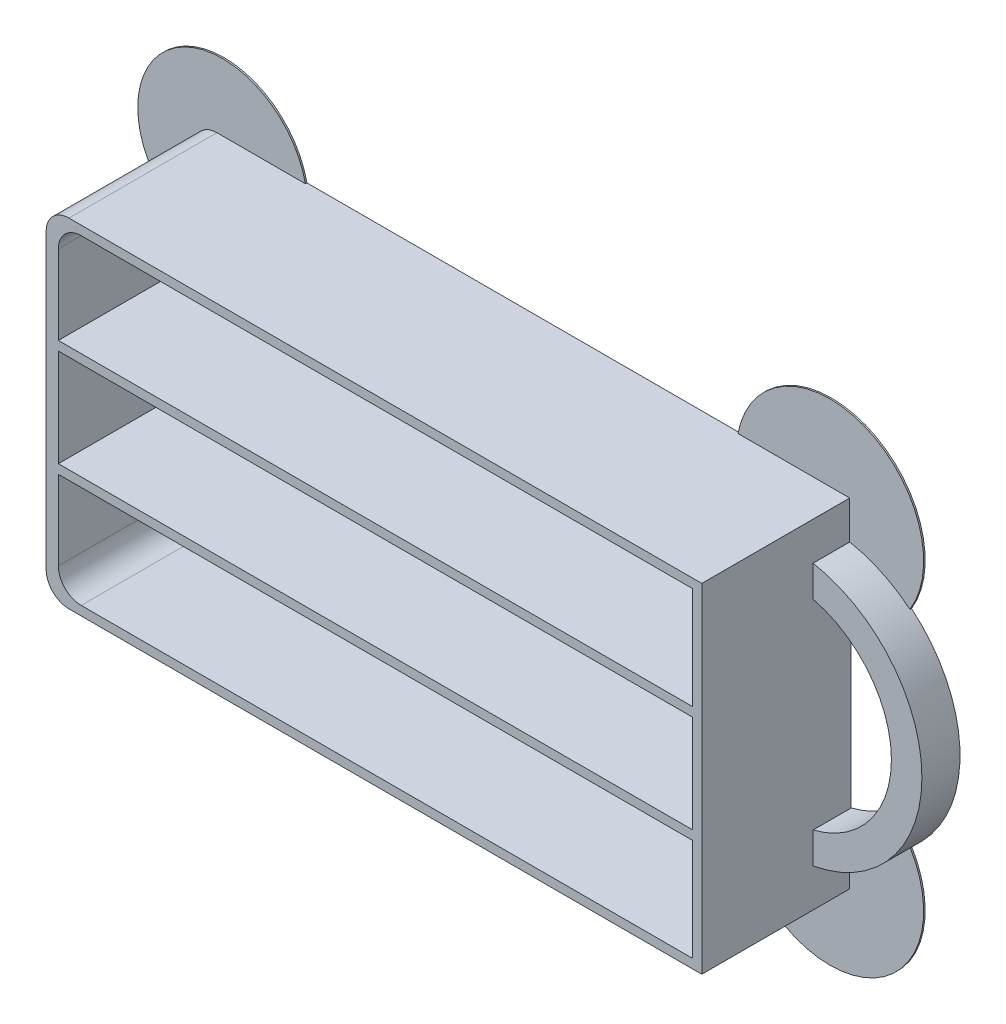
ISO-10303-21;
HEADER;
FILE_DESCRIPTION(('STEP AP214'),'2;1');
FILE_NAME('part.step','',(''),(''),'','','');
FILE_SCHEMA(('AUTOMOTIVE_DESIGN { 1 0 10303 214 1 1 1 1 }'));
ENDSEC;
DATA;
#1=APPLICATION_CONTEXT('core data for automotive mechanical design processes');
#2=APPLICATION_PROTOCOL_DEFINITION('international standard','automotive_design',2000,#1);
#3=PRODUCT_CONTEXT('',#1,'mechanical');
#4=PRODUCT('Part','Part','',(#3));
#5=PRODUCT_RELATED_PRODUCT_CATEGORY('part','',(#4));
#6=PRODUCT_DEFINITION_FORMATION('','',#4);
#7=PRODUCT_DEFINITION_CONTEXT('part definition',#1,'design');
#8=PRODUCT_DEFINITION('design','',#6,#7);
#9=PRODUCT_DEFINITION_SHAPE('','',#8);
#10=(LENGTH_UNIT() NAMED_UNIT(*) SI_UNIT(.MILLI.,.METRE.));
#11=(NAMED_UNIT(*) PLANE_ANGLE_UNIT() SI_UNIT($,.RADIAN.));
#12=(NAMED_UNIT(*) SI_UNIT($,.STERADIAN.) SOLID_ANGLE_UNIT());
#13=UNCERTAINTY_MEASURE_WITH_UNIT(LENGTH_MEASURE(1.E-05),#10,'distance_accuracy_value','');
#14=(GEOMETRIC_REPRESENTATION_CONTEXT(3) GLOBAL_UNCERTAINTY_ASSIGNED_CONTEXT((#13)) GLOBAL_UNIT_ASSIGNED_CONTEXT((#10,
#11,#12)) REPRESENTATION_CONTEXT('',''));
#15=CARTESIAN_POINT('',(0.,0.,0.));
#16=DIRECTION('',(0.,0.,1.));
#17=DIRECTION('',(1.,0.,0.));
#18=AXIS2_PLACEMENT_3D('',#15,#16,#17);
#19=CARTESIAN_POINT('',(-40.,-19.2,19.6));
#20=DIRECTION('',(0.,0.,-1.));
#21=DIRECTION('',(-1.,0.,0.));
#22=AXIS2_PLACEMENT_3D('',#19,#20,#21);
#23=CYLINDRICAL_SURFACE('',#22,3.);
#24=DIRECTION('',(0.,0.,-1.));
#25=VECTOR('',#24,1.);
#26=CARTESIAN_POINT('',(-43.,-19.2,19.6));
#27=LINE('',#26,#25);
#28=CARTESIAN_POINT('',(-43.,-19.2,0.199999999999999));
#29=VERTEX_POINT('',#28);
#30=CARTESIAN_POINT('',(-43.,-19.2,19.6));
#31=VERTEX_POINT('',#30);
#32=EDGE_CURVE('E462',#29,#31,#27,.F.);
#33=ORIENTED_EDGE('',*,*,#32,.F.);
#34=CARTESIAN_POINT('',(-40.,-19.2,0.199999999999999));
#35=DIRECTION('',(0.,0.,-1.));
#36=DIRECTION('',(-1.,0.,0.));
#37=AXIS2_PLACEMENT_3D('',#34,#35,#36);
#38=CIRCLE('',#37,3.);
#39=CARTESIAN_POINT('',(-40.,-22.2,0.199999999999999));
#40=VERTEX_POINT('',#39);
#41=EDGE_CURVE('E49',#29,#40,#38,.F.);
#42=ORIENTED_EDGE('',*,*,#41,.T.);
#43=DIRECTION('',(0.,0.,-1.));
#44=VECTOR('',#43,1.);
#45=CARTESIAN_POINT('',(-40.,-22.2,19.6));
#46=LINE('',#45,#44);
#47=CARTESIAN_POINT('',(-40.,-22.2,19.6));
#48=VERTEX_POINT('',#47);
#49=EDGE_CURVE('E473',#48,#40,#46,.T.);
#50=ORIENTED_EDGE('',*,*,#49,.F.);
#51=CARTESIAN_POINT('',(-40.,-19.2,19.6));
#52=DIRECTION('',(0.,0.,1.));
#53=DIRECTION('',(1.,0.,0.));
#54=AXIS2_PLACEMENT_3D('',#51,#52,#53);
#55=CIRCLE('',#54,3.);
#56=EDGE_CURVE('E469',#31,#48,#55,.T.);
#57=ORIENTED_EDGE('',*,*,#56,.F.);
#58=EDGE_LOOP('',(#33,#42,#50,#57));
#59=FACE_BOUND('',#58,.T.);
#60=ADVANCED_FACE('F41',(#59),#23,.T.);
#61=CARTESIAN_POINT('',(43.,22.2,19.6));
#62=DIRECTION('',(-1.,0.,0.));
#63=DIRECTION('',(0.,-1.,0.));
#64=AXIS2_PLACEMENT_3D('',#61,#62,#63);
#65=PLANE('',#64);
#66=DIRECTION('',(0.,0.,-1.));
#67=VECTOR('',#66,1.);
#68=CARTESIAN_POINT('',(43.,-22.2,19.6));
#69=LINE('',#68,#67);
#70=CARTESIAN_POINT('',(43.,-22.2,19.6));
#71=VERTEX_POINT('',#70);
#72=CARTESIAN_POINT('',(43.,-22.2,0.199999999999999));
#73=VERTEX_POINT('',#72);
#74=EDGE_CURVE('E449',#71,#73,#69,.T.);
#75=ORIENTED_EDGE('',*,*,#74,.T.);
#76=DIRECTION('',(0.,1.,0.));
#77=VECTOR('',#76,1.);
#78=CARTESIAN_POINT('',(43.,22.2,0.199999999999999));
#79=LINE('',#78,#77);
#80=CARTESIAN_POINT('',(43.,-17.2,0.2));
#81=VERTEX_POINT('',#80);
#82=EDGE_CURVE('E273',#73,#81,#79,.T.);
#83=ORIENTED_EDGE('',*,*,#82,.T.);
#84=DIRECTION('',(0.,0.,-1.));
#85=VECTOR('',#84,1.);
#86=CARTESIAN_POINT('',(43.,-17.2,5.));
#87=LINE('',#86,#85);
#88=CARTESIAN_POINT('',(43.,-17.2,5.));
#89=VERTEX_POINT('',#88);
#90=EDGE_CURVE('E422',#89,#81,#87,.T.);
#91=ORIENTED_EDGE('',*,*,#90,.F.);
#92=DIRECTION('',(0.,-1.,0.));
#93=VECTOR('',#92,1.);
#94=CARTESIAN_POINT('',(43.,-17.2,5.));
#95=LINE('',#94,#93);
#96=CARTESIAN_POINT('',(43.,-13.1087756865391,5.));
#97=VERTEX_POINT('',#96);
#98=EDGE_CURVE('E420',#97,#89,#95,.T.);
#99=ORIENTED_EDGE('',*,*,#98,.F.);
#100=DIRECTION('',(0.,0.,-1.));
#101=VECTOR('',#100,1.);
#102=CARTESIAN_POINT('',(43.,-13.1087756865391,5.));
#103=LINE('',#102,#101);
#104=CARTESIAN_POINT('',(43.,-13.1087756865391,0.));
#105=VERTEX_POINT('',#104);
#106=EDGE_CURVE('E427',#97,#105,#103,.T.);
#107=ORIENTED_EDGE('',*,*,#106,.T.);
#108=DIRECTION('',(0.,1.,0.));
#109=VECTOR('',#108,1.);
#110=CARTESIAN_POINT('',(43.,22.2,0.));
#111=LINE('',#110,#109);
#112=CARTESIAN_POINT('',(43.,13.1087756865391,0.));
#113=VERTEX_POINT('',#112);
#114=EDGE_CURVE('E436',#105,#113,#111,.T.);
#115=ORIENTED_EDGE('',*,*,#114,.T.);
#116=DIRECTION('',(0.,0.,-1.));
#117=VECTOR('',#116,1.);
#118=CARTESIAN_POINT('',(43.,13.1087756865391,5.));
#119=LINE('',#118,#117);
#120=CARTESIAN_POINT('',(43.,13.1087756865391,5.));
#121=VERTEX_POINT('',#120);
#122=EDGE_CURVE('E430',#121,#113,#119,.T.);
#123=ORIENTED_EDGE('',*,*,#122,.F.);
#124=DIRECTION('',(0.,-1.,0.));
#125=VECTOR('',#124,1.);
#126=CARTESIAN_POINT('',(43.,17.2,5.));
#127=LINE('',#126,#125);
#128=CARTESIAN_POINT('',(43.,17.2,5.));
#129=VERTEX_POINT('',#128);
#130=EDGE_CURVE('E414',#129,#121,#127,.T.);
#131=ORIENTED_EDGE('',*,*,#130,.F.);
#132=DIRECTION('',(0.,0.,-1.));
#133=VECTOR('',#132,1.);
#134=CARTESIAN_POINT('',(43.,17.2,5.));
#135=LINE('',#134,#133);
#136=CARTESIAN_POINT('',(43.,17.2,0.2));
#137=VERTEX_POINT('',#136);
#138=EDGE_CURVE('E433',#129,#137,#135,.T.);
#139=ORIENTED_EDGE('',*,*,#138,.T.);
#140=DIRECTION('',(0.,-1.,0.));
#141=VECTOR('',#140,1.);
#142=CARTESIAN_POINT('',(43.,22.2,0.199999999999999));
#143=LINE('',#142,#141);
#144=CARTESIAN_POINT('',(43.,22.2,0.199999999999999));
#145=VERTEX_POINT('',#144);
#146=EDGE_CURVE('E320',#145,#137,#143,.T.);
#147=ORIENTED_EDGE('',*,*,#146,.F.);
#148=DIRECTION('',(0.,0.,-1.));
#149=VECTOR('',#148,1.);
#150=CARTESIAN_POINT('',(43.,22.2,19.6));
#151=LINE('',#150,#149);
#152=CARTESIAN_POINT('',(43.,22.2,19.6));
#153=VERTEX_POINT('',#152);
#154=EDGE_CURVE('E459',#153,#145,#151,.T.);
#155=ORIENTED_EDGE('',*,*,#154,.F.);
#156=DIRECTION('',(0.,1.,0.));
#157=VECTOR('',#156,1.);
#158=CARTESIAN_POINT('',(43.,22.2,19.6));
#159=LINE('',#158,#157);
#160=EDGE_CURVE('E437',#71,#153,#159,.T.);
#161=ORIENTED_EDGE('',*,*,#160,.F.);
#162=EDGE_LOOP('',(#75,#83,#91,#99,#107,#115,#123,#131,#139,#147,#155,#161));
#163=FACE_BOUND('',#162,.T.);
#164=ADVANCED_FACE('F545',(#163),#65,.F.);
#165=CARTESIAN_POINT('',(0.,0.,19.6));
#166=DIRECTION('',(0.,0.,1.));
#167=DIRECTION('',(1.,0.,0.));
#168=AXIS2_PLACEMENT_3D('',#165,#166,#167);
#169=PLANE('',#168);
#170=DIRECTION('',(-1.,0.,0.));
#171=VECTOR('',#170,1.);
#172=CARTESIAN_POINT('',(0.,21.,19.6));
#173=LINE('',#172,#171);
#174=CARTESIAN_POINT('',(41.8,21.,19.6));
#175=VERTEX_POINT('',#174);
#176=CARTESIAN_POINT('',(-38.4,21.,19.6));
#177=VERTEX_POINT('',#176);
#178=EDGE_CURVE('E336',#175,#177,#173,.T.);
#179=ORIENTED_EDGE('',*,*,#178,.F.);
#180=DIRECTION('',(0.,1.,0.));
#181=VECTOR('',#180,1.);
#182=CARTESIAN_POINT('',(41.8,0.,19.6));
#183=LINE('',#182,#181);
#184=CARTESIAN_POINT('',(41.8,7.6,19.6));
#185=VERTEX_POINT('',#184);
#186=EDGE_CURVE('E345',#185,#175,#183,.T.);
#187=ORIENTED_EDGE('',*,*,#186,.F.);
#188=DIRECTION('',(-1.,0.,0.));
#189=VECTOR('',#188,1.);
#190=CARTESIAN_POINT('',(0.,7.6,19.6));
#191=LINE('',#190,#189);
#192=CARTESIAN_POINT('',(-41.4,7.6,19.6));
#193=VERTEX_POINT('',#192);
#194=EDGE_CURVE('E342',#185,#193,#191,.T.);
#195=ORIENTED_EDGE('',*,*,#194,.T.);
#196=DIRECTION('',(0.,-1.,0.));
#197=VECTOR('',#196,1.);
#198=CARTESIAN_POINT('',(-41.4,0.,19.6));
#199=LINE('',#198,#197);
#200=CARTESIAN_POINT('',(-41.4,18.,19.6));
#201=VERTEX_POINT('',#200);
#202=EDGE_CURVE('E339',#201,#193,#199,.T.);
#203=ORIENTED_EDGE('',*,*,#202,.F.);
#204=CARTESIAN_POINT('',(-38.4,18.,19.6));
#205=DIRECTION('',(0.,0.,1.));
#206=DIRECTION('',(1.,0.,0.));
#207=AXIS2_PLACEMENT_3D('',#204,#205,#206);
#208=CIRCLE('',#207,3.);
#209=EDGE_CURVE('E492',#201,#177,#208,.F.);
#210=ORIENTED_EDGE('',*,*,#209,.T.);
#211=EDGE_LOOP('',(#179,#187,#195,#203,#210));
#212=FACE_BOUND('',#211,.T.);
#213=DIRECTION('',(0.,1.,0.));
#214=VECTOR('',#213,1.);
#215=CARTESIAN_POINT('',(41.8,0.,19.6));
#216=LINE('',#215,#214);
#217=CARTESIAN_POINT('',(41.8,-21.,19.6));
#218=VERTEX_POINT('',#217);
#219=CARTESIAN_POINT('',(41.8,-7.6,19.6));
#220=VERTEX_POINT('',#219);
#221=EDGE_CURVE('E327',#218,#220,#216,.T.);
#222=ORIENTED_EDGE('',*,*,#221,.F.);
#223=DIRECTION('',(1.,0.,0.));
#224=VECTOR('',#223,1.);
#225=CARTESIAN_POINT('',(0.,-21.,19.6));
#226=LINE('',#225,#224);
#227=CARTESIAN_POINT('',(-38.4,-21.,19.6));
#228=VERTEX_POINT('',#227);
#229=EDGE_CURVE('E401',#228,#218,#226,.T.);
#230=ORIENTED_EDGE('',*,*,#229,.F.);
#231=CARTESIAN_POINT('',(-38.4,-18.,19.6));
#232=DIRECTION('',(0.,0.,1.));
#233=DIRECTION('',(1.,0.,0.));
#234=AXIS2_PLACEMENT_3D('',#231,#232,#233);
#235=CIRCLE('',#234,3.);
#236=CARTESIAN_POINT('',(-41.4,-18.,19.6));
#237=VERTEX_POINT('',#236);
#238=EDGE_CURVE('E490',#228,#237,#235,.F.);
#239=ORIENTED_EDGE('',*,*,#238,.T.);
#240=DIRECTION('',(0.,-1.,0.));
#241=VECTOR('',#240,1.);
#242=CARTESIAN_POINT('',(-41.4,0.,19.6));
#243=LINE('',#242,#241);
#244=CARTESIAN_POINT('',(-41.4,-7.6,19.6));
#245=VERTEX_POINT('',#244);
#246=EDGE_CURVE('E398',#245,#237,#243,.T.);
#247=ORIENTED_EDGE('',*,*,#246,.F.);
#248=DIRECTION('',(-1.,0.,0.));
#249=VECTOR('',#248,1.);
#250=CARTESIAN_POINT('',(0.,-7.6,19.6));
#251=LINE('',#250,#249);
#252=EDGE_CURVE('E395',#220,#245,#251,.T.);
#253=ORIENTED_EDGE('',*,*,#252,.F.);
#254=EDGE_LOOP('',(#222,#230,#239,#247,#253));
#255=FACE_BOUND('',#254,.T.);
#256=DIRECTION('',(-1.,0.,0.));
#257=VECTOR('',#256,1.);
#258=CARTESIAN_POINT('',(-43.,22.2,19.6));
#259=LINE('',#258,#257);
#260=CARTESIAN_POINT('',(-40.,22.2,19.6));
#261=VERTEX_POINT('',#260);
#262=EDGE_CURVE('E440',#153,#261,#259,.T.);
#263=ORIENTED_EDGE('',*,*,#262,.T.);
#264=CARTESIAN_POINT('',(-40.,19.2,19.6));
#265=DIRECTION('',(0.,0.,1.));
#266=DIRECTION('',(1.,0.,0.));
#267=AXIS2_PLACEMENT_3D('',#264,#265,#266);
#268=CIRCLE('',#267,3.);
#269=CARTESIAN_POINT('',(-43.,19.2,19.6));
#270=VERTEX_POINT('',#269);
#271=EDGE_CURVE('E471',#261,#270,#268,.T.);
#272=ORIENTED_EDGE('',*,*,#271,.T.);
#273=DIRECTION('',(0.,-1.,0.));
#274=VECTOR('',#273,1.);
#275=CARTESIAN_POINT('',(-43.,22.2,19.6));
#276=LINE('',#275,#274);
#277=EDGE_CURVE('E444',#270,#31,#276,.T.);
#278=ORIENTED_EDGE('',*,*,#277,.T.);
#279=ORIENTED_EDGE('',*,*,#56,.T.);
#280=DIRECTION('',(1.,0.,0.));
#281=VECTOR('',#280,1.);
#282=CARTESIAN_POINT('',(-43.,-22.2,19.6));
#283=LINE('',#282,#281);
#284=EDGE_CURVE('E447',#48,#71,#283,.T.);
#285=ORIENTED_EDGE('',*,*,#284,.T.);
#286=ORIENTED_EDGE('',*,*,#160,.T.);
#287=EDGE_LOOP('',(#263,#272,#278,#279,#285,#286));
#288=FACE_BOUND('',#287,.T.);
#289=DIRECTION('',(0.,1.,0.));
#290=VECTOR('',#289,1.);
#291=CARTESIAN_POINT('',(41.8,0.,19.6));
#292=LINE('',#291,#290);
#293=CARTESIAN_POINT('',(41.8,-6.4,19.6));
#294=VERTEX_POINT('',#293);
#295=CARTESIAN_POINT('',(41.8,6.4,19.6));
#296=VERTEX_POINT('',#295);
#297=EDGE_CURVE('E367',#294,#296,#292,.T.);
#298=ORIENTED_EDGE('',*,*,#297,.F.);
#299=DIRECTION('',(-1.,0.,0.));
#300=VECTOR('',#299,1.);
#301=CARTESIAN_POINT('',(0.,-6.4,19.6));
#302=LINE('',#301,#300);
#303=CARTESIAN_POINT('',(-41.4,-6.4,19.6));
#304=VERTEX_POINT('',#303);
#305=EDGE_CURVE('E364',#294,#304,#302,.T.);
#306=ORIENTED_EDGE('',*,*,#305,.T.);
#307=DIRECTION('',(0.,-1.,0.));
#308=VECTOR('',#307,1.);
#309=CARTESIAN_POINT('',(-41.4,0.,19.6));
#310=LINE('',#309,#308);
#311=CARTESIAN_POINT('',(-41.4,6.4,19.6));
#312=VERTEX_POINT('',#311);
#313=EDGE_CURVE('E374',#312,#304,#310,.T.);
#314=ORIENTED_EDGE('',*,*,#313,.F.);
#315=DIRECTION('',(-1.,0.,0.));
#316=VECTOR('',#315,1.);
#317=CARTESIAN_POINT('',(0.,6.4,19.6));
#318=LINE('',#317,#316);
#319=EDGE_CURVE('E371',#296,#312,#318,.T.);
#320=ORIENTED_EDGE('',*,*,#319,.F.);
#321=EDGE_LOOP('',(#298,#306,#314,#320));
#322=FACE_BOUND('',#321,.T.);
#323=ADVANCED_FACE('F510',(#212,#255,#288,#322),#169,.T.);
#324=CARTESIAN_POINT('',(-43.,22.2,19.6));
#325=DIRECTION('',(0.,-1.,0.));
#326=DIRECTION('',(0.,0.,-1.));
#327=AXIS2_PLACEMENT_3D('',#324,#325,#326);
#328=PLANE('',#327);
#329=DIRECTION('',(-1.,0.,0.));
#330=VECTOR('',#329,1.);
#331=CARTESIAN_POINT('',(-43.,22.2,0.));
#332=LINE('',#331,#330);
#333=CARTESIAN_POINT('',(28.3502205420116,22.2,0.));
#334=VERTEX_POINT('',#333);
#335=CARTESIAN_POINT('',(-28.3957505106809,22.2,0.));
#336=VERTEX_POINT('',#335);
#337=EDGE_CURVE('E451',#334,#336,#332,.T.);
#338=ORIENTED_EDGE('',*,*,#337,.T.);
#339=DIRECTION('',(0.,0.,-1.));
#340=VECTOR('',#339,1.);
#341=CARTESIAN_POINT('',(-28.3957505106809,22.2,0.2));
#342=LINE('',#341,#340);
#343=CARTESIAN_POINT('',(-28.3957505106809,22.2,0.2));
#344=VERTEX_POINT('',#343);
#345=EDGE_CURVE('E297',#344,#336,#342,.T.);
#346=ORIENTED_EDGE('',*,*,#345,.F.);
#347=DIRECTION('',(-1.,0.,0.));
#348=VECTOR('',#347,1.);
#349=CARTESIAN_POINT('',(-43.,22.2,0.199999999999999));
#350=LINE('',#349,#348);
#351=CARTESIAN_POINT('',(-40.,22.2,0.199999999999999));
#352=VERTEX_POINT('',#351);
#353=EDGE_CURVE('E310',#344,#352,#350,.T.);
#354=ORIENTED_EDGE('',*,*,#353,.T.);
#355=DIRECTION('',(0.,0.,-1.));
#356=VECTOR('',#355,1.);
#357=CARTESIAN_POINT('',(-40.,22.2,19.6));
#358=LINE('',#357,#356);
#359=EDGE_CURVE('E467',#352,#261,#358,.F.);
#360=ORIENTED_EDGE('',*,*,#359,.T.);
#361=ORIENTED_EDGE('',*,*,#262,.F.);
#362=ORIENTED_EDGE('',*,*,#154,.T.);
#363=DIRECTION('',(1.,0.,0.));
#364=VECTOR('',#363,1.);
#365=CARTESIAN_POINT('',(-43.,22.2,0.199999999999999));
#366=LINE('',#365,#364);
#367=CARTESIAN_POINT('',(28.3502205420118,22.2,0.199999999999999));
#368=VERTEX_POINT('',#367);
#369=EDGE_CURVE('E324',#368,#145,#366,.T.);
#370=ORIENTED_EDGE('',*,*,#369,.F.);
#371=DIRECTION('',(0.,0.,-1.));
#372=VECTOR('',#371,1.);
#373=CARTESIAN_POINT('',(28.3502205420118,22.2,0.2));
#374=LINE('',#373,#372);
#375=EDGE_CURVE('E318',#368,#334,#374,.T.);
#376=ORIENTED_EDGE('',*,*,#375,.T.);
#377=EDGE_LOOP('',(#338,#346,#354,#360,#361,#362,#370,#376));
#378=FACE_BOUND('',#377,.T.);
#379=ADVANCED_FACE('F527',(#378),#328,.F.);
#380=CARTESIAN_POINT('',(-43.,22.2,19.6));
#381=DIRECTION('',(1.,0.,0.));
#382=DIRECTION('',(0.,1.,0.));
#383=AXIS2_PLACEMENT_3D('',#380,#381,#382);
#384=PLANE('',#383);
#385=DIRECTION('',(0.,-1.,0.));
#386=VECTOR('',#385,1.);
#387=CARTESIAN_POINT('',(-43.,22.2,0.));
#388=LINE('',#387,#386);
#389=CARTESIAN_POINT('',(-43.,9.41790296159919,0.));
#390=VERTEX_POINT('',#389);
#391=CARTESIAN_POINT('',(-43.,-9.41790296159919,0.));
#392=VERTEX_POINT('',#391);
#393=EDGE_CURVE('E454',#390,#392,#388,.T.);
#394=ORIENTED_EDGE('',*,*,#393,.T.);
#395=DIRECTION('',(0.,0.,-1.));
#396=VECTOR('',#395,1.);
#397=CARTESIAN_POINT('',(-43.,-9.41790296159919,0.2));
#398=LINE('',#397,#396);
#399=CARTESIAN_POINT('',(-43.,-9.41790296159919,0.2));
#400=VERTEX_POINT('',#399);
#401=EDGE_CURVE('E282',#400,#392,#398,.T.);
#402=ORIENTED_EDGE('',*,*,#401,.F.);
#403=DIRECTION('',(0.,1.,0.));
#404=VECTOR('',#403,1.);
#405=CARTESIAN_POINT('',(-43.,22.2,0.199999999999999));
#406=LINE('',#405,#404);
#407=EDGE_CURVE('E294',#29,#400,#406,.T.);
#408=ORIENTED_EDGE('',*,*,#407,.F.);
#409=ORIENTED_EDGE('',*,*,#32,.T.);
#410=ORIENTED_EDGE('',*,*,#277,.F.);
#411=DIRECTION('',(0.,0.,-1.));
#412=VECTOR('',#411,1.);
#413=CARTESIAN_POINT('',(-43.,19.2,19.6));
#414=LINE('',#413,#412);
#415=CARTESIAN_POINT('',(-43.,19.2,0.199999999999999));
#416=VERTEX_POINT('',#415);
#417=EDGE_CURVE('E464',#270,#416,#414,.T.);
#418=ORIENTED_EDGE('',*,*,#417,.T.);
#419=DIRECTION('',(0.,-1.,0.));
#420=VECTOR('',#419,1.);
#421=CARTESIAN_POINT('',(-43.,22.2,0.199999999999999));
#422=LINE('',#421,#420);
#423=CARTESIAN_POINT('',(-43.,9.41790296159919,0.2));
#424=VERTEX_POINT('',#423);
#425=EDGE_CURVE('E305',#416,#424,#422,.T.);
#426=ORIENTED_EDGE('',*,*,#425,.T.);
#427=DIRECTION('',(0.,0.,-1.));
#428=VECTOR('',#427,1.);
#429=CARTESIAN_POINT('',(-43.,9.41790296159919,0.2));
#430=LINE('',#429,#428);
#431=EDGE_CURVE('E296',#424,#390,#430,.T.);
#432=ORIENTED_EDGE('',*,*,#431,.T.);
#433=EDGE_LOOP('',(#394,#402,#408,#409,#410,#418,#426,#432));
#434=FACE_BOUND('',#433,.T.);
#435=ADVANCED_FACE('F517',(#434),#384,.F.);
#436=CARTESIAN_POINT('',(-43.,-22.2,19.6));
#437=DIRECTION('',(0.,1.,0.));
#438=DIRECTION('',(0.,0.,1.));
#439=AXIS2_PLACEMENT_3D('',#436,#437,#438);
#440=PLANE('',#439);
#441=DIRECTION('',(1.,0.,0.));
#442=VECTOR('',#441,1.);
#443=CARTESIAN_POINT('',(-43.,-22.2,0.));
#444=LINE('',#443,#442);
#445=CARTESIAN_POINT('',(-28.3957505106809,-22.2,0.));
#446=VERTEX_POINT('',#445);
#447=CARTESIAN_POINT('',(28.3502205420116,-22.2,0.));
#448=VERTEX_POINT('',#447);
#449=EDGE_CURVE('E441',#446,#448,#444,.T.);
#450=ORIENTED_EDGE('',*,*,#449,.T.);
#451=DIRECTION('',(0.,0.,-1.));
#452=VECTOR('',#451,1.);
#453=CARTESIAN_POINT('',(28.3502205420118,-22.2,0.2));
#454=LINE('',#453,#452);
#455=CARTESIAN_POINT('',(28.3502205420118,-22.2,0.199999999999999));
#456=VERTEX_POINT('',#455);
#457=EDGE_CURVE('E56',#456,#448,#454,.T.);
#458=ORIENTED_EDGE('',*,*,#457,.F.);
#459=DIRECTION('',(1.,0.,0.));
#460=VECTOR('',#459,1.);
#461=CARTESIAN_POINT('',(-43.,-22.2,0.199999999999999));
#462=LINE('',#461,#460);
#463=EDGE_CURVE('E60',#456,#73,#462,.T.);
#464=ORIENTED_EDGE('',*,*,#463,.T.);
#465=ORIENTED_EDGE('',*,*,#74,.F.);
#466=ORIENTED_EDGE('',*,*,#284,.F.);
#467=ORIENTED_EDGE('',*,*,#49,.T.);
#468=DIRECTION('',(-1.,0.,0.));
#469=VECTOR('',#468,1.);
#470=CARTESIAN_POINT('',(-43.,-22.2,0.199999999999999));
#471=LINE('',#470,#469);
#472=CARTESIAN_POINT('',(-28.3957505106809,-22.2,0.2));
#473=VERTEX_POINT('',#472);
#474=EDGE_CURVE('E290',#473,#40,#471,.T.);
#475=ORIENTED_EDGE('',*,*,#474,.F.);
#476=DIRECTION('',(0.,0.,-1.));
#477=VECTOR('',#476,1.);
#478=CARTESIAN_POINT('',(-28.3957505106809,-22.2,0.2));
#479=LINE('',#478,#477);
#480=EDGE_CURVE('E281',#473,#446,#479,.T.);
#481=ORIENTED_EDGE('',*,*,#480,.T.);
#482=EDGE_LOOP('',(#450,#458,#464,#465,#466,#467,#475,#481));
#483=FACE_BOUND('',#482,.T.);
#484=ADVANCED_FACE('F507',(#483),#440,.F.);
#485=CARTESIAN_POINT('',(0.,0.,0.));
#486=DIRECTION('',(0.,0.,1.));
#487=DIRECTION('',(1.,0.,0.));
#488=AXIS2_PLACEMENT_3D('',#485,#486,#487);
#489=PLANE('',#488);
#490=CARTESIAN_POINT('',(39.7735468390197,0.,0.));
#491=DIRECTION('',(0.,0.,1.));
#492=DIRECTION('',(1.,0.,0.));
#493=AXIS2_PLACEMENT_3D('',#490,#491,#492);
#494=CIRCLE('',#493,17.5);
#495=CARTESIAN_POINT('',(50.9089345737472,-13.5001162956946,0.));
#496=VERTEX_POINT('',#495);
#497=CARTESIAN_POINT('',(50.9089345737472,13.5001162956946,0.));
#498=VERTEX_POINT('',#497);
#499=EDGE_CURVE('E248',#496,#498,#494,.T.);
#500=ORIENTED_EDGE('',*,*,#499,.F.);
#501=CARTESIAN_POINT('',(40.4153685929348,-19.8876066773456,0.));
#502=DIRECTION('',(0.,0.,-1.));
#503=DIRECTION('',(1.,0.,0.));
#504=AXIS2_PLACEMENT_3D('',#501,#502,#503);
#505=CIRCLE('',#504,12.2847450266315);
#506=EDGE_CURVE('E254',#496,#448,#505,.T.);
#507=ORIENTED_EDGE('',*,*,#506,.T.);
#508=ORIENTED_EDGE('',*,*,#449,.F.);
#509=CARTESIAN_POINT('',(-39.2676421609632,-19.8876066773456,0.));
#510=DIRECTION('',(0.,0.,-1.));
#511=DIRECTION('',(-1.,0.,0.));
#512=AXIS2_PLACEMENT_3D('',#509,#510,#511);
#513=CIRCLE('',#512,11.1150884357316);
#514=EDGE_CURVE('E287',#446,#392,#513,.T.);
#515=ORIENTED_EDGE('',*,*,#514,.T.);
#516=ORIENTED_EDGE('',*,*,#393,.F.);
#517=CARTESIAN_POINT('',(-39.2676421609632,19.8876066773456,0.));
#518=DIRECTION('',(0.,0.,-1.));
#519=DIRECTION('',(1.,0.,0.));
#520=AXIS2_PLACEMENT_3D('',#517,#518,#519);
#521=CIRCLE('',#520,11.1150884357316);
#522=EDGE_CURVE('E302',#390,#336,#521,.T.);
#523=ORIENTED_EDGE('',*,*,#522,.T.);
#524=ORIENTED_EDGE('',*,*,#337,.F.);
#525=CARTESIAN_POINT('',(40.4153685929348,19.8876066773456,0.));
#526=DIRECTION('',(0.,0.,-1.));
#527=DIRECTION('',(-1.,0.,0.));
#528=AXIS2_PLACEMENT_3D('',#525,#526,#527);
#529=CIRCLE('',#528,12.2847450266315);
#530=EDGE_CURVE('E257',#334,#498,#529,.T.);
#531=ORIENTED_EDGE('',*,*,#530,.T.);
#532=EDGE_LOOP('',(#500,#507,#508,#515,#516,#523,#524,#531));
#533=FACE_BOUND('',#532,.T.);
#534=CARTESIAN_POINT('',(39.7735468390197,0.,0.));
#535=DIRECTION('',(0.,0.,-1.));
#536=DIRECTION('',(1.,0.,0.));
#537=AXIS2_PLACEMENT_3D('',#534,#535,#536);
#538=CIRCLE('',#537,13.5);
#539=EDGE_CURVE('E260',#113,#105,#538,.T.);
#540=ORIENTED_EDGE('',*,*,#539,.F.);
#541=ORIENTED_EDGE('',*,*,#114,.F.);
#542=EDGE_LOOP('',(#540,#541));
#543=FACE_BOUND('',#542,.T.);
#544=ADVANCED_FACE('F250',(#533,#543),#489,.F.);
#545=CARTESIAN_POINT('',(39.7735468390197,0.,5.));
#546=DIRECTION('',(0.,0.,-1.));
#547=DIRECTION('',(-1.,0.,0.));
#548=AXIS2_PLACEMENT_3D('',#545,#546,#547);
#549=CYLINDRICAL_SURFACE('',#548,17.5);
#550=CARTESIAN_POINT('',(39.7735468390197,0.,0.2));
#551=DIRECTION('',(0.,0.,1.));
#552=DIRECTION('',(1.,0.,0.));
#553=AXIS2_PLACEMENT_3D('',#550,#551,#552);
#554=CIRCLE('',#553,17.5);
#555=CARTESIAN_POINT('',(50.9089345737472,-13.5001162956946,0.2));
#556=VERTEX_POINT('',#555);
#557=EDGE_CURVE('E12',#81,#556,#554,.T.);
#558=ORIENTED_EDGE('',*,*,#557,.T.);
#559=DIRECTION('',(0.,0.,-1.));
#560=VECTOR('',#559,1.);
#561=CARTESIAN_POINT('',(50.9089345737472,-13.5001162956946,0.2));
#562=LINE('',#561,#560);
#563=EDGE_CURVE('E264',#556,#496,#562,.T.);
#564=ORIENTED_EDGE('',*,*,#563,.T.);
#565=ORIENTED_EDGE('',*,*,#499,.T.);
#566=DIRECTION('',(0.,0.,-1.));
#567=VECTOR('',#566,1.);
#568=CARTESIAN_POINT('',(50.9089345737472,13.5001162956946,0.2));
#569=LINE('',#568,#567);
#570=CARTESIAN_POINT('',(50.9089345737472,13.5001162956946,0.2));
#571=VERTEX_POINT('',#570);
#572=EDGE_CURVE('E316',#571,#498,#569,.T.);
#573=ORIENTED_EDGE('',*,*,#572,.F.);
#574=CARTESIAN_POINT('',(39.7735468390197,0.,0.2));
#575=DIRECTION('',(0.,0.,-1.));
#576=DIRECTION('',(-1.,0.,0.));
#577=AXIS2_PLACEMENT_3D('',#574,#575,#576);
#578=CIRCLE('',#577,17.5);
#579=EDGE_CURVE('E494',#137,#571,#578,.T.);
#580=ORIENTED_EDGE('',*,*,#579,.F.);
#581=ORIENTED_EDGE('',*,*,#138,.F.);
#582=CARTESIAN_POINT('',(39.7735468390197,0.,5.));
#583=DIRECTION('',(0.,0.,1.));
#584=DIRECTION('',(1.,0.,0.));
#585=AXIS2_PLACEMENT_3D('',#582,#583,#584);
#586=CIRCLE('',#585,17.5);
#587=EDGE_CURVE('E411',#89,#129,#586,.T.);
#588=ORIENTED_EDGE('',*,*,#587,.F.);
#589=ORIENTED_EDGE('',*,*,#90,.T.);
#590=EDGE_LOOP('',(#558,#564,#565,#573,#580,#581,#588,#589));
#591=FACE_BOUND('',#590,.T.);
#592=ADVANCED_FACE('F265',(#591),#549,.T.);
#593=CARTESIAN_POINT('',(39.7735468390197,0.,5.));
#594=DIRECTION('',(0.,0.,-1.));
#595=DIRECTION('',(-1.,0.,0.));
#596=AXIS2_PLACEMENT_3D('',#593,#594,#595);
#597=CYLINDRICAL_SURFACE('',#596,13.5);
#598=ORIENTED_EDGE('',*,*,#539,.T.);
#599=ORIENTED_EDGE('',*,*,#106,.F.);
#600=CARTESIAN_POINT('',(39.7735468390197,0.,5.));
#601=DIRECTION('',(0.,0.,-1.));
#602=DIRECTION('',(1.,0.,0.));
#603=AXIS2_PLACEMENT_3D('',#600,#601,#602);
#604=CIRCLE('',#603,13.5);
#605=EDGE_CURVE('E417',#121,#97,#604,.T.);
#606=ORIENTED_EDGE('',*,*,#605,.F.);
#607=ORIENTED_EDGE('',*,*,#122,.T.);
#608=EDGE_LOOP('',(#598,#599,#606,#607));
#609=FACE_BOUND('',#608,.T.);
#610=ADVANCED_FACE('F605',(#609),#597,.F.);
#611=CARTESIAN_POINT('',(39.7735468390197,0.,5.));
#612=DIRECTION('',(0.,0.,1.));
#613=DIRECTION('',(1.,0.,0.));
#614=AXIS2_PLACEMENT_3D('',#611,#612,#613);
#615=PLANE('',#614);
#616=ORIENTED_EDGE('',*,*,#587,.T.);
#617=ORIENTED_EDGE('',*,*,#130,.T.);
#618=ORIENTED_EDGE('',*,*,#605,.T.);
#619=ORIENTED_EDGE('',*,*,#98,.T.);
#620=EDGE_LOOP('',(#616,#617,#618,#619));
#621=FACE_BOUND('',#620,.T.);
#622=ADVANCED_FACE('F602',(#621),#615,.T.);
#623=CARTESIAN_POINT('',(41.8,0.,-84.2721780898061));
#624=DIRECTION('',(1.,0.,0.));
#625=DIRECTION('',(0.,1.,0.));
#626=AXIS2_PLACEMENT_3D('',#623,#624,#625);
#627=PLANE('',#626);
#628=DIRECTION('',(0.,-1.,0.));
#629=VECTOR('',#628,1.);
#630=CARTESIAN_POINT('',(41.8,0.,1.20000000000001));
#631=LINE('',#630,#629);
#632=CARTESIAN_POINT('',(41.8,-7.6,1.20000000000001));
#633=VERTEX_POINT('',#632);
#634=CARTESIAN_POINT('',(41.8,-21.,1.20000000000001));
#635=VERTEX_POINT('',#634);
#636=EDGE_CURVE('E392',#633,#635,#631,.T.);
#637=ORIENTED_EDGE('',*,*,#636,.T.);
#638=DIRECTION('',(0.,0.,1.));
#639=VECTOR('',#638,1.);
#640=CARTESIAN_POINT('',(41.8,-21.,-84.2721780898061));
#641=LINE('',#640,#639);
#642=EDGE_CURVE('E389',#635,#218,#641,.T.);
#643=ORIENTED_EDGE('',*,*,#642,.T.);
#644=ORIENTED_EDGE('',*,*,#221,.T.);
#645=DIRECTION('',(0.,0.,1.));
#646=VECTOR('',#645,1.);
#647=CARTESIAN_POINT('',(41.8,-7.6,-84.2721780898061));
#648=LINE('',#647,#646);
#649=EDGE_CURVE('E403',#633,#220,#648,.T.);
#650=ORIENTED_EDGE('',*,*,#649,.F.);
#651=EDGE_LOOP('',(#637,#643,#644,#650));
#652=FACE_BOUND('',#651,.T.);
#653=ADVANCED_FACE('F580',(#652),#627,.F.);
#654=CARTESIAN_POINT('',(0.,-21.,-84.2721780898061));
#655=DIRECTION('',(0.,-1.,0.));
#656=DIRECTION('',(0.,0.,-1.));
#657=AXIS2_PLACEMENT_3D('',#654,#655,#656);
#658=PLANE('',#657);
#659=DIRECTION('',(-1.,0.,0.));
#660=VECTOR('',#659,1.);
#661=CARTESIAN_POINT('',(0.,-21.,1.20000000000001));
#662=LINE('',#661,#660);
#663=CARTESIAN_POINT('',(-38.4,-21.,1.20000000000001));
#664=VERTEX_POINT('',#663);
#665=EDGE_CURVE('E388',#635,#664,#662,.T.);
#666=ORIENTED_EDGE('',*,*,#665,.T.);
#667=DIRECTION('',(0.,0.,1.));
#668=VECTOR('',#667,1.);
#669=CARTESIAN_POINT('',(-38.4,-21.,19.6));
#670=LINE('',#669,#668);
#671=EDGE_CURVE('E476',#664,#228,#670,.T.);
#672=ORIENTED_EDGE('',*,*,#671,.T.);
#673=ORIENTED_EDGE('',*,*,#229,.T.);
#674=ORIENTED_EDGE('',*,*,#642,.F.);
#675=EDGE_LOOP('',(#666,#672,#673,#674));
#676=FACE_BOUND('',#675,.T.);
#677=ADVANCED_FACE('F576',(#676),#658,.F.);
#678=CARTESIAN_POINT('',(-41.4,0.,-84.2721780898061));
#679=DIRECTION('',(-1.,0.,0.));
#680=DIRECTION('',(0.,-1.,0.));
#681=AXIS2_PLACEMENT_3D('',#678,#679,#680);
#682=PLANE('',#681);
#683=ORIENTED_EDGE('',*,*,#246,.T.);
#684=DIRECTION('',(0.,0.,1.));
#685=VECTOR('',#684,1.);
#686=CARTESIAN_POINT('',(-41.4,-18.,1.20000000000001));
#687=LINE('',#686,#685);
#688=CARTESIAN_POINT('',(-41.4,-18.,1.20000000000001));
#689=VERTEX_POINT('',#688);
#690=EDGE_CURVE('E479',#237,#689,#687,.F.);
#691=ORIENTED_EDGE('',*,*,#690,.T.);
#692=DIRECTION('',(0.,1.,0.));
#693=VECTOR('',#692,1.);
#694=CARTESIAN_POINT('',(-41.4,0.,1.20000000000001));
#695=LINE('',#694,#693);
#696=CARTESIAN_POINT('',(-41.4,-7.6,1.20000000000001));
#697=VERTEX_POINT('',#696);
#698=EDGE_CURVE('E386',#689,#697,#695,.T.);
#699=ORIENTED_EDGE('',*,*,#698,.T.);
#700=DIRECTION('',(0.,0.,1.));
#701=VECTOR('',#700,1.);
#702=CARTESIAN_POINT('',(-41.4,-7.6,-84.2721780898061));
#703=LINE('',#702,#701);
#704=EDGE_CURVE('E406',#697,#245,#703,.T.);
#705=ORIENTED_EDGE('',*,*,#704,.T.);
#706=EDGE_LOOP('',(#683,#691,#699,#705));
#707=FACE_BOUND('',#706,.T.);
#708=ADVANCED_FACE('F589',(#707),#682,.F.);
#709=CARTESIAN_POINT('',(0.,-7.6,-84.2721780898061));
#710=DIRECTION('',(0.,1.,0.));
#711=DIRECTION('',(0.,0.,1.));
#712=AXIS2_PLACEMENT_3D('',#709,#710,#711);
#713=PLANE('',#712);
#714=DIRECTION('',(1.,0.,0.));
#715=VECTOR('',#714,1.);
#716=CARTESIAN_POINT('',(0.,-7.6,1.20000000000001));
#717=LINE('',#716,#715);
#718=EDGE_CURVE('E368',#697,#633,#717,.T.);
#719=ORIENTED_EDGE('',*,*,#718,.T.);
#720=ORIENTED_EDGE('',*,*,#649,.T.);
#721=ORIENTED_EDGE('',*,*,#252,.T.);
#722=ORIENTED_EDGE('',*,*,#704,.F.);
#723=EDGE_LOOP('',(#719,#720,#721,#722));
#724=FACE_BOUND('',#723,.T.);
#725=ADVANCED_FACE('F587',(#724),#713,.F.);
#726=CARTESIAN_POINT('',(0.,0.,1.2));
#727=DIRECTION('',(0.,0.,1.));
#728=DIRECTION('',(1.,0.,0.));
#729=AXIS2_PLACEMENT_3D('',#726,#727,#728);
#730=PLANE('',#729);
#731=ORIENTED_EDGE('',*,*,#698,.F.);
#732=CARTESIAN_POINT('',(-38.4,-18.,1.20000000000001));
#733=DIRECTION('',(0.,0.,1.));
#734=DIRECTION('',(1.,0.,0.));
#735=AXIS2_PLACEMENT_3D('',#732,#733,#734);
#736=CIRCLE('',#735,3.);
#737=EDGE_CURVE('E481',#689,#664,#736,.T.);
#738=ORIENTED_EDGE('',*,*,#737,.T.);
#739=ORIENTED_EDGE('',*,*,#665,.F.);
#740=ORIENTED_EDGE('',*,*,#636,.F.);
#741=ORIENTED_EDGE('',*,*,#718,.F.);
#742=EDGE_LOOP('',(#731,#738,#739,#740,#741));
#743=FACE_BOUND('',#742,.T.);
#744=ADVANCED_FACE('F571',(#743),#730,.T.);
#745=CARTESIAN_POINT('',(0.,-6.4,-84.2721780898061));
#746=DIRECTION('',(0.,1.,0.));
#747=DIRECTION('',(0.,0.,1.));
#748=AXIS2_PLACEMENT_3D('',#745,#746,#747);
#749=PLANE('',#748);
#750=DIRECTION('',(0.,0.,1.));
#751=VECTOR('',#750,1.);
#752=CARTESIAN_POINT('',(-41.4,-6.4,-84.2721780898061));
#753=LINE('',#752,#751);
#754=CARTESIAN_POINT('',(-41.4,-6.4,1.20000000000001));
#755=VERTEX_POINT('',#754);
#756=EDGE_CURVE('E359',#755,#304,#753,.T.);
#757=ORIENTED_EDGE('',*,*,#756,.T.);
#758=ORIENTED_EDGE('',*,*,#305,.F.);
#759=DIRECTION('',(0.,0.,1.));
#760=VECTOR('',#759,1.);
#761=CARTESIAN_POINT('',(41.8,-6.4,-84.2721780898061));
#762=LINE('',#761,#760);
#763=CARTESIAN_POINT('',(41.8,-6.4,1.20000000000001));
#764=VERTEX_POINT('',#763);
#765=EDGE_CURVE('E377',#764,#294,#762,.T.);
#766=ORIENTED_EDGE('',*,*,#765,.F.);
#767=DIRECTION('',(1.,0.,0.));
#768=VECTOR('',#767,1.);
#769=CARTESIAN_POINT('',(0.,-6.4,1.20000000000001));
#770=LINE('',#769,#768);
#771=EDGE_CURVE('E361',#755,#764,#770,.T.);
#772=ORIENTED_EDGE('',*,*,#771,.F.);
#773=EDGE_LOOP('',(#757,#758,#766,#772));
#774=FACE_BOUND('',#773,.T.);
#775=ADVANCED_FACE('F837',(#774),#749,.T.);
#776=CARTESIAN_POINT('',(-41.4,0.,-84.2721780898061));
#777=DIRECTION('',(-1.,0.,0.));
#778=DIRECTION('',(0.,-1.,0.));
#779=AXIS2_PLACEMENT_3D('',#776,#777,#778);
#780=PLANE('',#779);
#781=DIRECTION('',(0.,1.,0.));
#782=VECTOR('',#781,1.);
#783=CARTESIAN_POINT('',(-41.4,0.,1.20000000000001));
#784=LINE('',#783,#782);
#785=CARTESIAN_POINT('',(-41.4,6.4,1.20000000000001));
#786=VERTEX_POINT('',#785);
#787=EDGE_CURVE('E358',#755,#786,#784,.T.);
#788=ORIENTED_EDGE('',*,*,#787,.T.);
#789=DIRECTION('',(0.,0.,1.));
#790=VECTOR('',#789,1.);
#791=CARTESIAN_POINT('',(-41.4,6.4,-84.2721780898061));
#792=LINE('',#791,#790);
#793=EDGE_CURVE('E379',#786,#312,#792,.T.);
#794=ORIENTED_EDGE('',*,*,#793,.T.);
#795=ORIENTED_EDGE('',*,*,#313,.T.);
#796=ORIENTED_EDGE('',*,*,#756,.F.);
#797=EDGE_LOOP('',(#788,#794,#795,#796));
#798=FACE_BOUND('',#797,.T.);
#799=ADVANCED_FACE('F827',(#798),#780,.F.);
#800=CARTESIAN_POINT('',(0.,6.4,-84.2721780898061));
#801=DIRECTION('',(0.,1.,0.));
#802=DIRECTION('',(0.,0.,1.));
#803=AXIS2_PLACEMENT_3D('',#800,#801,#802);
#804=PLANE('',#803);
#805=DIRECTION('',(1.,0.,0.));
#806=VECTOR('',#805,1.);
#807=CARTESIAN_POINT('',(0.,6.4,1.20000000000001));
#808=LINE('',#807,#806);
#809=CARTESIAN_POINT('',(41.8,6.4,1.20000000000001));
#810=VERTEX_POINT('',#809);
#811=EDGE_CURVE('E356',#786,#810,#808,.T.);
#812=ORIENTED_EDGE('',*,*,#811,.T.);
#813=DIRECTION('',(0.,0.,1.));
#814=VECTOR('',#813,1.);
#815=CARTESIAN_POINT('',(41.8,6.4,-84.2721780898061));
#816=LINE('',#815,#814);
#817=EDGE_CURVE('E381',#810,#296,#816,.T.);
#818=ORIENTED_EDGE('',*,*,#817,.T.);
#819=ORIENTED_EDGE('',*,*,#319,.T.);
#820=ORIENTED_EDGE('',*,*,#793,.F.);
#821=EDGE_LOOP('',(#812,#818,#819,#820));
#822=FACE_BOUND('',#821,.T.);
#823=ADVANCED_FACE('F817',(#822),#804,.F.);
#824=CARTESIAN_POINT('',(41.8,0.,-84.2721780898061));
#825=DIRECTION('',(1.,0.,0.));
#826=DIRECTION('',(0.,1.,0.));
#827=AXIS2_PLACEMENT_3D('',#824,#825,#826);
#828=PLANE('',#827);
#829=DIRECTION('',(0.,-1.,0.));
#830=VECTOR('',#829,1.);
#831=CARTESIAN_POINT('',(41.8,0.,1.20000000000001));
#832=LINE('',#831,#830);
#833=EDGE_CURVE('E340',#810,#764,#832,.T.);
#834=ORIENTED_EDGE('',*,*,#833,.T.);
#835=ORIENTED_EDGE('',*,*,#765,.T.);
#836=ORIENTED_EDGE('',*,*,#297,.T.);
#837=ORIENTED_EDGE('',*,*,#817,.F.);
#838=EDGE_LOOP('',(#834,#835,#836,#837));
#839=FACE_BOUND('',#838,.T.);
#840=ADVANCED_FACE('F807',(#839),#828,.F.);
#841=CARTESIAN_POINT('',(0.,0.,1.2));
#842=DIRECTION('',(0.,0.,1.));
#843=DIRECTION('',(1.,0.,0.));
#844=AXIS2_PLACEMENT_3D('',#841,#842,#843);
#845=PLANE('',#844);
#846=ORIENTED_EDGE('',*,*,#787,.F.);
#847=ORIENTED_EDGE('',*,*,#771,.T.);
#848=ORIENTED_EDGE('',*,*,#833,.F.);
#849=ORIENTED_EDGE('',*,*,#811,.F.);
#850=EDGE_LOOP('',(#846,#847,#848,#849));
#851=FACE_BOUND('',#850,.T.);
#852=ADVANCED_FACE('F797',(#851),#845,.T.);
#853=CARTESIAN_POINT('',(0.,21.,-84.2721780898061));
#854=DIRECTION('',(0.,1.,0.));
#855=DIRECTION('',(0.,0.,1.));
#856=AXIS2_PLACEMENT_3D('',#853,#854,#855);
#857=PLANE('',#856);
#858=ORIENTED_EDGE('',*,*,#178,.T.);
#859=DIRECTION('',(0.,0.,1.));
#860=VECTOR('',#859,1.);
#861=CARTESIAN_POINT('',(-38.4,21.,1.20000000000001));
#862=LINE('',#861,#860);
#863=CARTESIAN_POINT('',(-38.4,21.,1.20000000000001));
#864=VERTEX_POINT('',#863);
#865=EDGE_CURVE('E486',#177,#864,#862,.F.);
#866=ORIENTED_EDGE('',*,*,#865,.T.);
#867=DIRECTION('',(1.,0.,0.));
#868=VECTOR('',#867,1.);
#869=CARTESIAN_POINT('',(0.,21.,1.20000000000001));
#870=LINE('',#869,#868);
#871=CARTESIAN_POINT('',(41.8,21.,1.20000000000001));
#872=VERTEX_POINT('',#871);
#873=EDGE_CURVE('E334',#864,#872,#870,.T.);
#874=ORIENTED_EDGE('',*,*,#873,.T.);
#875=DIRECTION('',(0.,0.,1.));
#876=VECTOR('',#875,1.);
#877=CARTESIAN_POINT('',(41.8,21.,-84.2721780898061));
#878=LINE('',#877,#876);
#879=EDGE_CURVE('E332',#872,#175,#878,.T.);
#880=ORIENTED_EDGE('',*,*,#879,.T.);
#881=EDGE_LOOP('',(#858,#866,#874,#880));
#882=FACE_BOUND('',#881,.T.);
#883=ADVANCED_FACE('F787',(#882),#857,.F.);
#884=CARTESIAN_POINT('',(41.8,0.,-84.2721780898061));
#885=DIRECTION('',(1.,0.,0.));
#886=DIRECTION('',(0.,1.,0.));
#887=AXIS2_PLACEMENT_3D('',#884,#885,#886);
#888=PLANE('',#887);
#889=DIRECTION('',(0.,-1.,0.));
#890=VECTOR('',#889,1.);
#891=CARTESIAN_POINT('',(41.8,0.,1.20000000000001));
#892=LINE('',#891,#890);
#893=CARTESIAN_POINT('',(41.8,7.6,1.20000000000001));
#894=VERTEX_POINT('',#893);
#895=EDGE_CURVE('E331',#872,#894,#892,.T.);
#896=ORIENTED_EDGE('',*,*,#895,.T.);
#897=DIRECTION('',(0.,0.,1.));
#898=VECTOR('',#897,1.);
#899=CARTESIAN_POINT('',(41.8,7.6,-84.2721780898061));
#900=LINE('',#899,#898);
#901=EDGE_CURVE('E350',#894,#185,#900,.T.);
#902=ORIENTED_EDGE('',*,*,#901,.T.);
#903=ORIENTED_EDGE('',*,*,#186,.T.);
#904=ORIENTED_EDGE('',*,*,#879,.F.);
#905=EDGE_LOOP('',(#896,#902,#903,#904));
#906=FACE_BOUND('',#905,.T.);
#907=ADVANCED_FACE('F777',(#906),#888,.F.);
#908=CARTESIAN_POINT('',(0.,7.6,-84.2721780898061));
#909=DIRECTION('',(0.,1.,0.));
#910=DIRECTION('',(0.,0.,1.));
#911=AXIS2_PLACEMENT_3D('',#908,#909,#910);
#912=PLANE('',#911);
#913=DIRECTION('',(0.,0.,1.));
#914=VECTOR('',#913,1.);
#915=CARTESIAN_POINT('',(-41.4,7.6,-84.2721780898061));
#916=LINE('',#915,#914);
#917=CARTESIAN_POINT('',(-41.4,7.6,1.20000000000001));
#918=VERTEX_POINT('',#917);
#919=EDGE_CURVE('E348',#918,#193,#916,.T.);
#920=ORIENTED_EDGE('',*,*,#919,.T.);
#921=ORIENTED_EDGE('',*,*,#194,.F.);
#922=ORIENTED_EDGE('',*,*,#901,.F.);
#923=DIRECTION('',(1.,0.,0.));
#924=VECTOR('',#923,1.);
#925=CARTESIAN_POINT('',(0.,7.6,1.20000000000001));
#926=LINE('',#925,#924);
#927=EDGE_CURVE('E328',#918,#894,#926,.T.);
#928=ORIENTED_EDGE('',*,*,#927,.F.);
#929=EDGE_LOOP('',(#920,#921,#922,#928));
#930=FACE_BOUND('',#929,.T.);
#931=ADVANCED_FACE('F767',(#930),#912,.T.);
#932=CARTESIAN_POINT('',(-41.4,0.,-84.2721780898061));
#933=DIRECTION('',(-1.,0.,0.));
#934=DIRECTION('',(0.,-1.,0.));
#935=AXIS2_PLACEMENT_3D('',#932,#933,#934);
#936=PLANE('',#935);
#937=DIRECTION('',(0.,1.,0.));
#938=VECTOR('',#937,1.);
#939=CARTESIAN_POINT('',(-41.4,0.,1.20000000000001));
#940=LINE('',#939,#938);
#941=CARTESIAN_POINT('',(-41.4,18.,1.20000000000001));
#942=VERTEX_POINT('',#941);
#943=EDGE_CURVE('E261',#918,#942,#940,.T.);
#944=ORIENTED_EDGE('',*,*,#943,.T.);
#945=DIRECTION('',(0.,0.,1.));
#946=VECTOR('',#945,1.);
#947=CARTESIAN_POINT('',(-41.4,18.,19.6));
#948=LINE('',#947,#946);
#949=EDGE_CURVE('E483',#942,#201,#948,.T.);
#950=ORIENTED_EDGE('',*,*,#949,.T.);
#951=ORIENTED_EDGE('',*,*,#202,.T.);
#952=ORIENTED_EDGE('',*,*,#919,.F.);
#953=EDGE_LOOP('',(#944,#950,#951,#952));
#954=FACE_BOUND('',#953,.T.);
#955=ADVANCED_FACE('F757',(#954),#936,.F.);
#956=CARTESIAN_POINT('',(0.,0.,1.2));
#957=DIRECTION('',(0.,0.,1.));
#958=DIRECTION('',(1.,0.,0.));
#959=AXIS2_PLACEMENT_3D('',#956,#957,#958);
#960=PLANE('',#959);
#961=ORIENTED_EDGE('',*,*,#873,.F.);
#962=CARTESIAN_POINT('',(-38.4,18.,1.20000000000001));
#963=DIRECTION('',(0.,0.,1.));
#964=DIRECTION('',(1.,0.,0.));
#965=AXIS2_PLACEMENT_3D('',#962,#963,#964);
#966=CIRCLE('',#965,3.);
#967=EDGE_CURVE('E488',#864,#942,#966,.T.);
#968=ORIENTED_EDGE('',*,*,#967,.T.);
#969=ORIENTED_EDGE('',*,*,#943,.F.);
#970=ORIENTED_EDGE('',*,*,#927,.T.);
#971=ORIENTED_EDGE('',*,*,#895,.F.);
#972=EDGE_LOOP('',(#961,#968,#969,#970,#971));
#973=FACE_BOUND('',#972,.T.);
#974=ADVANCED_FACE('F564',(#973),#960,.T.);
#975=CARTESIAN_POINT('',(-40.,19.2,19.6));
#976=DIRECTION('',(0.,0.,-1.));
#977=DIRECTION('',(-1.,0.,0.));
#978=AXIS2_PLACEMENT_3D('',#975,#976,#977);
#979=CYLINDRICAL_SURFACE('',#978,3.);
#980=CARTESIAN_POINT('',(-40.,19.2,0.199999999999999));
#981=DIRECTION('',(0.,0.,1.));
#982=DIRECTION('',(1.,0.,0.));
#983=AXIS2_PLACEMENT_3D('',#980,#981,#982);
#984=CIRCLE('',#983,3.);
#985=EDGE_CURVE('E497',#416,#352,#984,.F.);
#986=ORIENTED_EDGE('',*,*,#985,.F.);
#987=ORIENTED_EDGE('',*,*,#417,.F.);
#988=ORIENTED_EDGE('',*,*,#271,.F.);
#989=ORIENTED_EDGE('',*,*,#359,.F.);
#990=EDGE_LOOP('',(#986,#987,#988,#989));
#991=FACE_BOUND('',#990,.T.);
#992=ADVANCED_FACE('F520',(#991),#979,.T.);
#993=CARTESIAN_POINT('',(-38.4,-18.,-84.2721780898061));
#994=DIRECTION('',(0.,0.,-1.));
#995=DIRECTION('',(-1.,0.,0.));
#996=AXIS2_PLACEMENT_3D('',#993,#994,#995);
#997=CYLINDRICAL_SURFACE('',#996,3.);
#998=ORIENTED_EDGE('',*,*,#737,.F.);
#999=ORIENTED_EDGE('',*,*,#690,.F.);
#1000=ORIENTED_EDGE('',*,*,#238,.F.);
#1001=ORIENTED_EDGE('',*,*,#671,.F.);
#1002=EDGE_LOOP('',(#998,#999,#1000,#1001));
#1003=FACE_BOUND('',#1002,.T.);
#1004=ADVANCED_FACE('F554',(#1003),#997,.F.);
#1005=CARTESIAN_POINT('',(-38.4,18.,-84.2721780898061));
#1006=DIRECTION('',(0.,0.,-1.));
#1007=DIRECTION('',(-1.,0.,0.));
#1008=AXIS2_PLACEMENT_3D('',#1005,#1006,#1007);
#1009=CYLINDRICAL_SURFACE('',#1008,3.);
#1010=ORIENTED_EDGE('',*,*,#967,.F.);
#1011=ORIENTED_EDGE('',*,*,#865,.F.);
#1012=ORIENTED_EDGE('',*,*,#209,.F.);
#1013=ORIENTED_EDGE('',*,*,#949,.F.);
#1014=EDGE_LOOP('',(#1010,#1011,#1012,#1013));
#1015=FACE_BOUND('',#1014,.T.);
#1016=ADVANCED_FACE('F43',(#1015),#1009,.F.);
#1017=CARTESIAN_POINT('',(40.4153685929348,19.8876066773456,0.2));
#1018=DIRECTION('',(0.,0.,-1.));
#1019=DIRECTION('',(-1.,0.,0.));
#1020=AXIS2_PLACEMENT_3D('',#1017,#1018,#1019);
#1021=CYLINDRICAL_SURFACE('',#1020,12.2847450266315);
#1022=ORIENTED_EDGE('',*,*,#530,.F.);
#1023=ORIENTED_EDGE('',*,*,#375,.F.);
#1024=CARTESIAN_POINT('',(40.4153685929348,19.8876066773456,0.2));
#1025=DIRECTION('',(0.,0.,-1.));
#1026=DIRECTION('',(-1.,0.,0.));
#1027=AXIS2_PLACEMENT_3D('',#1024,#1025,#1026);
#1028=CIRCLE('',#1027,12.2847450266315);
#1029=EDGE_CURVE('E313',#368,#571,#1028,.T.);
#1030=ORIENTED_EDGE('',*,*,#1029,.T.);
#1031=ORIENTED_EDGE('',*,*,#572,.T.);
#1032=EDGE_LOOP('',(#1022,#1023,#1030,#1031));
#1033=FACE_BOUND('',#1032,.T.);
#1034=ADVANCED_FACE('F561',(#1033),#1021,.T.);
#1035=CARTESIAN_POINT('',(40.4153685929348,19.8876066773456,0.2));
#1036=DIRECTION('',(0.,0.,-1.));
#1037=DIRECTION('',(-1.,0.,0.));
#1038=AXIS2_PLACEMENT_3D('',#1035,#1036,#1037);
#1039=PLANE('',#1038);
#1040=ORIENTED_EDGE('',*,*,#1029,.F.);
#1041=ORIENTED_EDGE('',*,*,#369,.T.);
#1042=ORIENTED_EDGE('',*,*,#146,.T.);
#1043=ORIENTED_EDGE('',*,*,#579,.T.);
#1044=EDGE_LOOP('',(#1040,#1041,#1042,#1043));
#1045=FACE_BOUND('',#1044,.T.);
#1046=ADVANCED_FACE('F657',(#1045),#1039,.F.);
#1047=CARTESIAN_POINT('',(-39.2676421609632,19.8876066773456,0.2));
#1048=DIRECTION('',(0.,0.,1.));
#1049=DIRECTION('',(1.,0.,0.));
#1050=AXIS2_PLACEMENT_3D('',#1047,#1048,#1049);
#1051=PLANE('',#1050);
#1052=ORIENTED_EDGE('',*,*,#353,.F.);
#1053=CARTESIAN_POINT('',(-39.2676421609632,19.8876066773456,0.2));
#1054=DIRECTION('',(0.,0.,-1.));
#1055=DIRECTION('',(1.,0.,0.));
#1056=AXIS2_PLACEMENT_3D('',#1053,#1054,#1055);
#1057=CIRCLE('',#1056,11.1150884357316);
#1058=EDGE_CURVE('E299',#424,#344,#1057,.T.);
#1059=ORIENTED_EDGE('',*,*,#1058,.F.);
#1060=ORIENTED_EDGE('',*,*,#425,.F.);
#1061=ORIENTED_EDGE('',*,*,#985,.T.);
#1062=EDGE_LOOP('',(#1052,#1059,#1060,#1061));
#1063=FACE_BOUND('',#1062,.T.);
#1064=ADVANCED_FACE('F523',(#1063),#1051,.T.);
#1065=CARTESIAN_POINT('',(-39.2676421609632,19.8876066773456,0.2));
#1066=DIRECTION('',(0.,0.,-1.));
#1067=DIRECTION('',(-1.,0.,0.));
#1068=AXIS2_PLACEMENT_3D('',#1065,#1066,#1067);
#1069=CYLINDRICAL_SURFACE('',#1068,11.1150884357316);
#1070=ORIENTED_EDGE('',*,*,#522,.F.);
#1071=ORIENTED_EDGE('',*,*,#431,.F.);
#1072=ORIENTED_EDGE('',*,*,#1058,.T.);
#1073=ORIENTED_EDGE('',*,*,#345,.T.);
#1074=EDGE_LOOP('',(#1070,#1071,#1072,#1073));
#1075=FACE_BOUND('',#1074,.T.);
#1076=ADVANCED_FACE('F529',(#1075),#1069,.T.);
#1077=CARTESIAN_POINT('',(-39.2676421609632,-19.8876066773456,0.2));
#1078=DIRECTION('',(0.,0.,-1.));
#1079=DIRECTION('',(-1.,0.,0.));
#1080=AXIS2_PLACEMENT_3D('',#1077,#1078,#1079);
#1081=PLANE('',#1080);
#1082=ORIENTED_EDGE('',*,*,#41,.F.);
#1083=ORIENTED_EDGE('',*,*,#407,.T.);
#1084=CARTESIAN_POINT('',(-39.2676421609632,-19.8876066773456,0.2));
#1085=DIRECTION('',(0.,0.,-1.));
#1086=DIRECTION('',(-1.,0.,0.));
#1087=AXIS2_PLACEMENT_3D('',#1084,#1085,#1086);
#1088=CIRCLE('',#1087,11.1150884357316);
#1089=EDGE_CURVE('E284',#473,#400,#1088,.T.);
#1090=ORIENTED_EDGE('',*,*,#1089,.F.);
#1091=ORIENTED_EDGE('',*,*,#474,.T.);
#1092=EDGE_LOOP('',(#1082,#1083,#1090,#1091));
#1093=FACE_BOUND('',#1092,.T.);
#1094=ADVANCED_FACE('F535',(#1093),#1081,.F.);
#1095=CARTESIAN_POINT('',(-39.2676421609632,-19.8876066773456,0.2));
#1096=DIRECTION('',(0.,0.,-1.));
#1097=DIRECTION('',(-1.,0.,0.));
#1098=AXIS2_PLACEMENT_3D('',#1095,#1096,#1097);
#1099=CYLINDRICAL_SURFACE('',#1098,11.1150884357316);
#1100=ORIENTED_EDGE('',*,*,#514,.F.);
#1101=ORIENTED_EDGE('',*,*,#480,.F.);
#1102=ORIENTED_EDGE('',*,*,#1089,.T.);
#1103=ORIENTED_EDGE('',*,*,#401,.T.);
#1104=EDGE_LOOP('',(#1100,#1101,#1102,#1103));
#1105=FACE_BOUND('',#1104,.T.);
#1106=ADVANCED_FACE('F533',(#1105),#1099,.T.);
#1107=CARTESIAN_POINT('',(40.4153685929348,-19.8876066773456,0.2));
#1108=DIRECTION('',(0.,0.,-1.));
#1109=DIRECTION('',(-1.,0.,0.));
#1110=AXIS2_PLACEMENT_3D('',#1107,#1108,#1109);
#1111=CYLINDRICAL_SURFACE('',#1110,12.2847450266315);
#1112=ORIENTED_EDGE('',*,*,#506,.F.);
#1113=ORIENTED_EDGE('',*,*,#563,.F.);
#1114=CARTESIAN_POINT('',(40.4153685929348,-19.8876066773456,0.2));
#1115=DIRECTION('',(0.,0.,-1.));
#1116=DIRECTION('',(1.,0.,0.));
#1117=AXIS2_PLACEMENT_3D('',#1114,#1115,#1116);
#1118=CIRCLE('',#1117,12.2847450266315);
#1119=EDGE_CURVE('E274',#556,#456,#1118,.T.);
#1120=ORIENTED_EDGE('',*,*,#1119,.T.);
#1121=ORIENTED_EDGE('',*,*,#457,.T.);
#1122=EDGE_LOOP('',(#1112,#1113,#1120,#1121));
#1123=FACE_BOUND('',#1122,.T.);
#1124=ADVANCED_FACE('F272',(#1123),#1111,.T.);
#1125=CARTESIAN_POINT('',(40.4153685929348,-19.8876066773456,0.2));
#1126=DIRECTION('',(0.,0.,1.));
#1127=DIRECTION('',(1.,0.,0.));
#1128=AXIS2_PLACEMENT_3D('',#1125,#1126,#1127);
#1129=PLANE('',#1128);
#1130=ORIENTED_EDGE('',*,*,#463,.F.);
#1131=ORIENTED_EDGE('',*,*,#1119,.F.);
#1132=ORIENTED_EDGE('',*,*,#557,.F.);
#1133=ORIENTED_EDGE('',*,*,#82,.F.);
#1134=EDGE_LOOP('',(#1130,#1131,#1132,#1133));
#1135=FACE_BOUND('',#1134,.T.);
#1136=ADVANCED_FACE('F706',(#1135),#1129,.T.);
#1137=CLOSED_SHELL('',(#60,#164,#323,#379,#435,#484,#544,#592,#610,#622,#653,#677,#708,#725,
#744,#775,#799,#823,#840,#852,#883,#907,#931,#955,#974,#992,#1004,#1016,#1034,#1046,#1064,#1076,
#1094,#1106,#1124,#1136));
#1138=MANIFOLD_SOLID_BREP('B2',#1137);
#1139=ADVANCED_BREP_SHAPE_REPRESENTATION('',(#18,#1138),#14);
#1140=SHAPE_DEFINITION_REPRESENTATION(#9,#1139);
ENDSEC;
END-ISO-10303-21;
